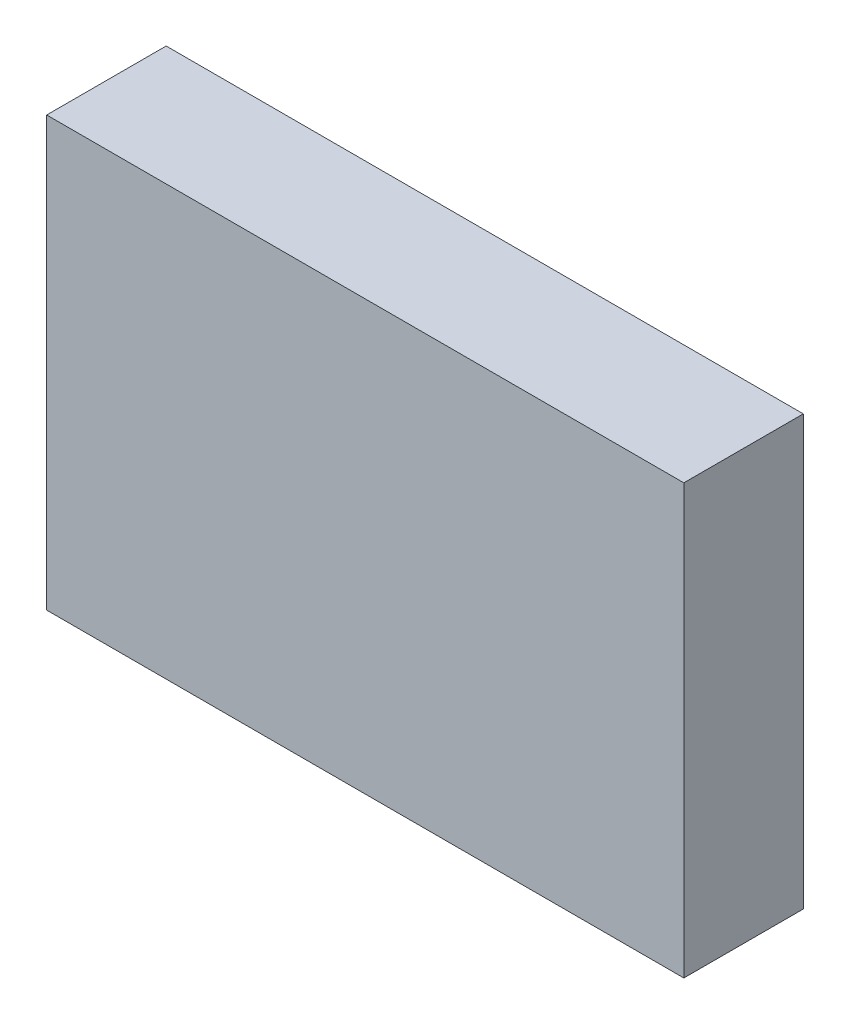
ISO-10303-21;
HEADER;
FILE_DESCRIPTION(('STEP AP214'),'2;1');
FILE_NAME('part.step','',(''),(''),'','','');
FILE_SCHEMA(('AUTOMOTIVE_DESIGN { 1 0 10303 214 1 1 1 1 }'));
ENDSEC;
DATA;
#1=APPLICATION_CONTEXT('core data for automotive mechanical design processes');
#2=APPLICATION_PROTOCOL_DEFINITION('international standard','automotive_design',2000,#1);
#3=PRODUCT_CONTEXT('',#1,'mechanical');
#4=PRODUCT('Part','Part','',(#3));
#5=PRODUCT_RELATED_PRODUCT_CATEGORY('part','',(#4));
#6=PRODUCT_DEFINITION_FORMATION('','',#4);
#7=PRODUCT_DEFINITION_CONTEXT('part definition',#1,'design');
#8=PRODUCT_DEFINITION('design','',#6,#7);
#9=PRODUCT_DEFINITION_SHAPE('','',#8);
#10=(LENGTH_UNIT() NAMED_UNIT(*) SI_UNIT(.MILLI.,.METRE.));
#11=(NAMED_UNIT(*) PLANE_ANGLE_UNIT() SI_UNIT($,.RADIAN.));
#12=(NAMED_UNIT(*) SI_UNIT($,.STERADIAN.) SOLID_ANGLE_UNIT());
#13=UNCERTAINTY_MEASURE_WITH_UNIT(LENGTH_MEASURE(1.E-05),#10,'distance_accuracy_value','');
#14=(GEOMETRIC_REPRESENTATION_CONTEXT(3) GLOBAL_UNCERTAINTY_ASSIGNED_CONTEXT((#13)) GLOBAL_UNIT_ASSIGNED_CONTEXT((#10,
#11,#12)) REPRESENTATION_CONTEXT('',''));
#15=CARTESIAN_POINT('',(0.,0.,0.));
#16=DIRECTION('',(0.,0.,1.));
#17=DIRECTION('',(1.,0.,0.));
#18=AXIS2_PLACEMENT_3D('',#15,#16,#17);
#19=CARTESIAN_POINT('',(-260.,-175.,97.5));
#20=DIRECTION('',(1.,0.,0.));
#21=DIRECTION('',(0.,0.,-1.));
#22=AXIS2_PLACEMENT_3D('',#19,#20,#21);
#23=PLANE('',#22);
#24=DIRECTION('',(0.,-1.,0.));
#25=VECTOR('',#24,1.);
#26=CARTESIAN_POINT('',(-260.,-175.,0.));
#27=LINE('',#26,#25);
#28=CARTESIAN_POINT('',(-260.,175.,0.));
#29=VERTEX_POINT('',#28);
#30=CARTESIAN_POINT('',(-260.,-175.,0.));
#31=VERTEX_POINT('',#30);
#32=EDGE_CURVE('E95',#29,#31,#27,.T.);
#33=ORIENTED_EDGE('',*,*,#32,.T.);
#34=DIRECTION('',(0.,0.,-1.));
#35=VECTOR('',#34,1.);
#36=CARTESIAN_POINT('',(-260.,-175.,97.5));
#37=LINE('',#36,#35);
#38=CARTESIAN_POINT('',(-260.,-175.,97.5));
#39=VERTEX_POINT('',#38);
#40=EDGE_CURVE('E11',#39,#31,#37,.T.);
#41=ORIENTED_EDGE('',*,*,#40,.F.);
#42=DIRECTION('',(0.,-1.,0.));
#43=VECTOR('',#42,1.);
#44=CARTESIAN_POINT('',(-260.,-175.,97.5));
#45=LINE('',#44,#43);
#46=CARTESIAN_POINT('',(-260.,175.,97.5));
#47=VERTEX_POINT('',#46);
#48=EDGE_CURVE('E83',#47,#39,#45,.T.);
#49=ORIENTED_EDGE('',*,*,#48,.F.);
#50=DIRECTION('',(0.,0.,-1.));
#51=VECTOR('',#50,1.);
#52=CARTESIAN_POINT('',(-260.,175.,97.5));
#53=LINE('',#52,#51);
#54=EDGE_CURVE('E91',#47,#29,#53,.T.);
#55=ORIENTED_EDGE('',*,*,#54,.T.);
#56=EDGE_LOOP('',(#33,#41,#49,#55));
#57=FACE_BOUND('',#56,.T.);
#58=ADVANCED_FACE('F32',(#57),#23,.F.);
#59=CARTESIAN_POINT('',(260.,-175.,97.5));
#60=DIRECTION('',(0.,1.,0.));
#61=DIRECTION('',(-1.,0.,0.));
#62=AXIS2_PLACEMENT_3D('',#59,#60,#61);
#63=PLANE('',#62);
#64=DIRECTION('',(1.,0.,0.));
#65=VECTOR('',#64,1.);
#66=CARTESIAN_POINT('',(260.,-175.,0.));
#67=LINE('',#66,#65);
#68=CARTESIAN_POINT('',(260.,-175.,0.));
#69=VERTEX_POINT('',#68);
#70=EDGE_CURVE('E87',#31,#69,#67,.T.);
#71=ORIENTED_EDGE('',*,*,#70,.T.);
#72=DIRECTION('',(0.,0.,-1.));
#73=VECTOR('',#72,1.);
#74=CARTESIAN_POINT('',(260.,-175.,97.5));
#75=LINE('',#74,#73);
#76=CARTESIAN_POINT('',(260.,-175.,97.5));
#77=VERTEX_POINT('',#76);
#78=EDGE_CURVE('E40',#77,#69,#75,.T.);
#79=ORIENTED_EDGE('',*,*,#78,.F.);
#80=DIRECTION('',(1.,0.,0.));
#81=VECTOR('',#80,1.);
#82=CARTESIAN_POINT('',(260.,-175.,97.5));
#83=LINE('',#82,#81);
#84=EDGE_CURVE('E78',#39,#77,#83,.T.);
#85=ORIENTED_EDGE('',*,*,#84,.F.);
#86=ORIENTED_EDGE('',*,*,#40,.T.);
#87=EDGE_LOOP('',(#71,#79,#85,#86));
#88=FACE_BOUND('',#87,.T.);
#89=ADVANCED_FACE('F86',(#88),#63,.F.);
#90=CARTESIAN_POINT('',(260.,-175.,97.5));
#91=DIRECTION('',(-1.,0.,0.));
#92=DIRECTION('',(0.,0.,1.));
#93=AXIS2_PLACEMENT_3D('',#90,#91,#92);
#94=PLANE('',#93);
#95=DIRECTION('',(0.,1.,0.));
#96=VECTOR('',#95,1.);
#97=CARTESIAN_POINT('',(260.,-175.,0.));
#98=LINE('',#97,#96);
#99=CARTESIAN_POINT('',(260.,175.,0.));
#100=VERTEX_POINT('',#99);
#101=EDGE_CURVE('E65',#69,#100,#98,.T.);
#102=ORIENTED_EDGE('',*,*,#101,.T.);
#103=DIRECTION('',(0.,0.,-1.));
#104=VECTOR('',#103,1.);
#105=CARTESIAN_POINT('',(260.,175.,97.5));
#106=LINE('',#105,#104);
#107=CARTESIAN_POINT('',(260.,175.,97.5));
#108=VERTEX_POINT('',#107);
#109=EDGE_CURVE('E88',#108,#100,#106,.T.);
#110=ORIENTED_EDGE('',*,*,#109,.F.);
#111=DIRECTION('',(0.,1.,0.));
#112=VECTOR('',#111,1.);
#113=CARTESIAN_POINT('',(260.,-175.,97.5));
#114=LINE('',#113,#112);
#115=EDGE_CURVE('E81',#77,#108,#114,.T.);
#116=ORIENTED_EDGE('',*,*,#115,.F.);
#117=ORIENTED_EDGE('',*,*,#78,.T.);
#118=EDGE_LOOP('',(#102,#110,#116,#117));
#119=FACE_BOUND('',#118,.T.);
#120=ADVANCED_FACE('F89',(#119),#94,.F.);
#121=CARTESIAN_POINT('',(260.,175.,97.5));
#122=DIRECTION('',(0.,-1.,0.));
#123=DIRECTION('',(1.,0.,0.));
#124=AXIS2_PLACEMENT_3D('',#121,#122,#123);
#125=PLANE('',#124);
#126=DIRECTION('',(-1.,0.,0.));
#127=VECTOR('',#126,1.);
#128=CARTESIAN_POINT('',(260.,175.,0.));
#129=LINE('',#128,#127);
#130=EDGE_CURVE('E71',#100,#29,#129,.T.);
#131=ORIENTED_EDGE('',*,*,#130,.T.);
#132=ORIENTED_EDGE('',*,*,#54,.F.);
#133=DIRECTION('',(-1.,0.,0.));
#134=VECTOR('',#133,1.);
#135=CARTESIAN_POINT('',(260.,175.,97.5));
#136=LINE('',#135,#134);
#137=EDGE_CURVE('E48',#108,#47,#136,.T.);
#138=ORIENTED_EDGE('',*,*,#137,.F.);
#139=ORIENTED_EDGE('',*,*,#109,.T.);
#140=EDGE_LOOP('',(#131,#132,#138,#139));
#141=FACE_BOUND('',#140,.T.);
#142=ADVANCED_FACE('F102',(#141),#125,.F.);
#143=CARTESIAN_POINT('',(0.,0.,97.5));
#144=DIRECTION('',(0.,0.,1.));
#145=DIRECTION('',(1.,0.,0.));
#146=AXIS2_PLACEMENT_3D('',#143,#144,#145);
#147=PLANE('',#146);
#148=ORIENTED_EDGE('',*,*,#48,.T.);
#149=ORIENTED_EDGE('',*,*,#84,.T.);
#150=ORIENTED_EDGE('',*,*,#115,.T.);
#151=ORIENTED_EDGE('',*,*,#137,.T.);
#152=EDGE_LOOP('',(#148,#149,#150,#151));
#153=FACE_BOUND('',#152,.T.);
#154=ADVANCED_FACE('F79',(#153),#147,.T.);
#155=CARTESIAN_POINT('',(0.,0.,0.));
#156=DIRECTION('',(0.,0.,1.));
#157=DIRECTION('',(1.,0.,0.));
#158=AXIS2_PLACEMENT_3D('',#155,#156,#157);
#159=PLANE('',#158);
#160=ORIENTED_EDGE('',*,*,#32,.F.);
#161=ORIENTED_EDGE('',*,*,#130,.F.);
#162=ORIENTED_EDGE('',*,*,#101,.F.);
#163=ORIENTED_EDGE('',*,*,#70,.F.);
#164=EDGE_LOOP('',(#160,#161,#162,#163));
#165=FACE_BOUND('',#164,.T.);
#166=ADVANCED_FACE('F105',(#165),#159,.F.);
#167=CLOSED_SHELL('',(#58,#89,#120,#142,#154,#166));
#168=MANIFOLD_SOLID_BREP('B2',#167);
#169=ADVANCED_BREP_SHAPE_REPRESENTATION('',(#18,#168),#14);
#170=SHAPE_DEFINITION_REPRESENTATION(#9,#169);
ENDSEC;
END-ISO-10303-21;
